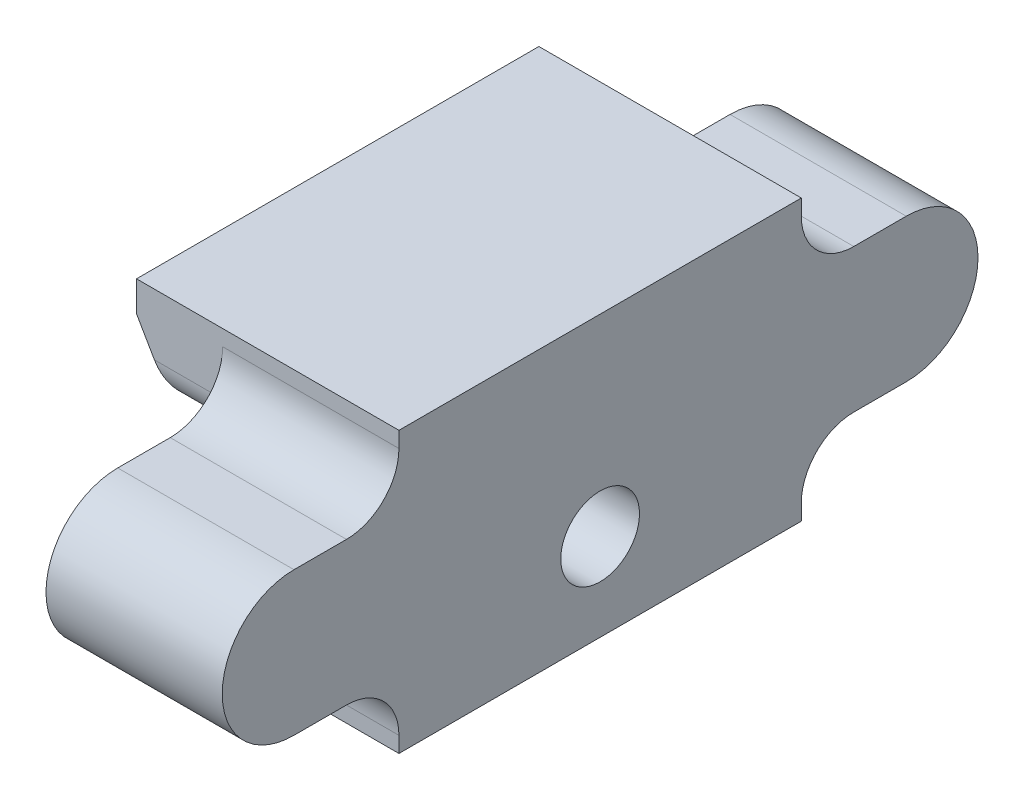
ISO-10303-21;
HEADER;
FILE_DESCRIPTION(('STEP AP214'),'2;1');
FILE_NAME('part.step','',(''),(''),'','','');
FILE_SCHEMA(('AUTOMOTIVE_DESIGN { 1 0 10303 214 1 1 1 1 }'));
ENDSEC;
DATA;
#1=APPLICATION_CONTEXT('core data for automotive mechanical design processes');
#2=APPLICATION_PROTOCOL_DEFINITION('international standard','automotive_design',2000,#1);
#3=PRODUCT_CONTEXT('',#1,'mechanical');
#4=PRODUCT('Part','Part','',(#3));
#5=PRODUCT_RELATED_PRODUCT_CATEGORY('part','',(#4));
#6=PRODUCT_DEFINITION_FORMATION('','',#4);
#7=PRODUCT_DEFINITION_CONTEXT('part definition',#1,'design');
#8=PRODUCT_DEFINITION('design','',#6,#7);
#9=PRODUCT_DEFINITION_SHAPE('','',#8);
#10=(LENGTH_UNIT() NAMED_UNIT(*) SI_UNIT(.MILLI.,.METRE.));
#11=(NAMED_UNIT(*) PLANE_ANGLE_UNIT() SI_UNIT($,.RADIAN.));
#12=(NAMED_UNIT(*) SI_UNIT($,.STERADIAN.) SOLID_ANGLE_UNIT());
#13=UNCERTAINTY_MEASURE_WITH_UNIT(LENGTH_MEASURE(1.E-05),#10,'distance_accuracy_value','');
#14=(GEOMETRIC_REPRESENTATION_CONTEXT(3) GLOBAL_UNCERTAINTY_ASSIGNED_CONTEXT((#13)) GLOBAL_UNIT_ASSIGNED_CONTEXT((#10,
#11,#12)) REPRESENTATION_CONTEXT('',''));
#15=CARTESIAN_POINT('',(0.,0.,0.));
#16=DIRECTION('',(0.,0.,1.));
#17=DIRECTION('',(1.,0.,0.));
#18=AXIS2_PLACEMENT_3D('',#15,#16,#17);
#19=CARTESIAN_POINT('',(0.,0.,23.));
#20=DIRECTION('',(0.,0.,-1.));
#21=DIRECTION('',(-1.,0.,0.));
#22=AXIS2_PLACEMENT_3D('',#19,#20,#21);
#23=PLANE('',#22);
#24=DIRECTION('',(0.,1.,0.));
#25=VECTOR('',#24,1.);
#26=CARTESIAN_POINT('',(0.,16.,23.));
#27=LINE('',#26,#25);
#28=CARTESIAN_POINT('',(0.,0.,23.));
#29=VERTEX_POINT('',#28);
#30=CARTESIAN_POINT('',(0.,0.900000000000001,23.));
#31=VERTEX_POINT('',#30);
#32=EDGE_CURVE('E281',#29,#31,#27,.T.);
#33=ORIENTED_EDGE('',*,*,#32,.T.);
#34=DIRECTION('',(1.,0.,0.));
#35=VECTOR('',#34,1.);
#36=CARTESIAN_POINT('',(-10.074573519457,0.900000000000001,23.));
#37=LINE('',#36,#35);
#38=CARTESIAN_POINT('',(-10.074573519457,0.900000000000001,23.));
#39=VERTEX_POINT('',#38);
#40=EDGE_CURVE('E292',#31,#39,#37,.F.);
#41=ORIENTED_EDGE('',*,*,#40,.T.);
#42=DIRECTION('',(0.,-1.,0.));
#43=VECTOR('',#42,1.);
#44=CARTESIAN_POINT('',(-10.074573519457,10.5,23.));
#45=LINE('',#44,#43);
#46=CARTESIAN_POINT('',(-10.074573519457,0.,23.));
#47=VERTEX_POINT('',#46);
#48=EDGE_CURVE('E293',#39,#47,#45,.T.);
#49=ORIENTED_EDGE('',*,*,#48,.T.);
#50=DIRECTION('',(1.,0.,0.));
#51=VECTOR('',#50,1.);
#52=CARTESIAN_POINT('',(0.,0.,23.));
#53=LINE('',#52,#51);
#54=EDGE_CURVE('E296',#47,#29,#53,.T.);
#55=ORIENTED_EDGE('',*,*,#54,.T.);
#56=EDGE_LOOP('',(#33,#41,#49,#55));
#57=FACE_BOUND('',#56,.T.);
#58=ADVANCED_FACE('F37',(#57),#23,.F.);
#59=CARTESIAN_POINT('',(0.,0.,0.));
#60=DIRECTION('',(0.,0.,-1.));
#61=DIRECTION('',(-1.,0.,0.));
#62=AXIS2_PLACEMENT_3D('',#59,#60,#61);
#63=PLANE('',#62);
#64=DIRECTION('',(0.,-1.,0.));
#65=VECTOR('',#64,1.);
#66=CARTESIAN_POINT('',(-10.074573519457,10.5,0.));
#67=LINE('',#66,#65);
#68=CARTESIAN_POINT('',(-10.074573519457,0.899999999999995,0.));
#69=VERTEX_POINT('',#68);
#70=CARTESIAN_POINT('',(-10.074573519457,0.,0.));
#71=VERTEX_POINT('',#70);
#72=EDGE_CURVE('E318',#69,#71,#67,.T.);
#73=ORIENTED_EDGE('',*,*,#72,.F.);
#74=DIRECTION('',(1.,0.,0.));
#75=VECTOR('',#74,1.);
#76=CARTESIAN_POINT('',(0.,0.899999999999996,0.));
#77=LINE('',#76,#75);
#78=CARTESIAN_POINT('',(0.,0.899999999999996,0.));
#79=VERTEX_POINT('',#78);
#80=EDGE_CURVE('E251',#69,#79,#77,.T.);
#81=ORIENTED_EDGE('',*,*,#80,.T.);
#82=DIRECTION('',(0.,1.,0.));
#83=VECTOR('',#82,1.);
#84=CARTESIAN_POINT('',(0.,16.,0.));
#85=LINE('',#84,#83);
#86=CARTESIAN_POINT('',(0.,0.,0.));
#87=VERTEX_POINT('',#86);
#88=EDGE_CURVE('E237',#87,#79,#85,.T.);
#89=ORIENTED_EDGE('',*,*,#88,.F.);
#90=DIRECTION('',(1.,0.,0.));
#91=VECTOR('',#90,1.);
#92=CARTESIAN_POINT('',(0.,0.,0.));
#93=LINE('',#92,#91);
#94=EDGE_CURVE('E320',#71,#87,#93,.T.);
#95=ORIENTED_EDGE('',*,*,#94,.F.);
#96=EDGE_LOOP('',(#73,#81,#89,#95));
#97=FACE_BOUND('',#96,.T.);
#98=ADVANCED_FACE('F388',(#97),#63,.T.);
#99=CARTESIAN_POINT('',(0.,16.,23.));
#100=DIRECTION('',(-1.,0.,0.));
#101=DIRECTION('',(0.,-1.,0.));
#102=AXIS2_PLACEMENT_3D('',#99,#100,#101);
#103=PLANE('',#102);
#104=CARTESIAN_POINT('',(0.,5.,11.5));
#105=DIRECTION('',(1.,0.,0.));
#106=DIRECTION('',(0.,0.,-1.));
#107=AXIS2_PLACEMENT_3D('',#104,#105,#106);
#108=CIRCLE('',#107,2.24999999999999);
#109=CARTESIAN_POINT('',(0.,5.,9.25000000000001));
#110=VERTEX_POINT('',#109);
#111=EDGE_CURVE('E215',#110,#110,#108,.T.);
#112=ORIENTED_EDGE('',*,*,#111,.F.);
#113=EDGE_LOOP('',(#112));
#114=FACE_BOUND('',#113,.T.);
#115=ORIENTED_EDGE('',*,*,#88,.T.);
#116=CARTESIAN_POINT('',(0.,0.899999999999996,-3.));
#117=DIRECTION('',(-1.,0.,0.));
#118=DIRECTION('',(0.,-1.,0.));
#119=AXIS2_PLACEMENT_3D('',#116,#117,#118);
#120=CIRCLE('',#119,3.);
#121=CARTESIAN_POINT('',(0.,3.9,-3.));
#122=VERTEX_POINT('',#121);
#123=EDGE_CURVE('E268',#79,#122,#120,.T.);
#124=ORIENTED_EDGE('',*,*,#123,.T.);
#125=DIRECTION('',(0.,0.,1.));
#126=VECTOR('',#125,1.);
#127=CARTESIAN_POINT('',(0.,3.9,0.));
#128=LINE('',#127,#126);
#129=CARTESIAN_POINT('',(0.,3.9,-6.));
#130=VERTEX_POINT('',#129);
#131=EDGE_CURVE('E220',#130,#122,#128,.T.);
#132=ORIENTED_EDGE('',*,*,#131,.F.);
#133=CARTESIAN_POINT('',(0.,8.,-6.));
#134=DIRECTION('',(-1.,0.,0.));
#135=DIRECTION('',(0.,-1.,0.));
#136=AXIS2_PLACEMENT_3D('',#133,#134,#135);
#137=CIRCLE('',#136,4.1);
#138=CARTESIAN_POINT('',(0.,12.1,-6.));
#139=VERTEX_POINT('',#138);
#140=EDGE_CURVE('E217',#139,#130,#137,.T.);
#141=ORIENTED_EDGE('',*,*,#140,.F.);
#142=DIRECTION('',(0.,0.,-1.));
#143=VECTOR('',#142,1.);
#144=CARTESIAN_POINT('',(0.,12.1,-6.));
#145=LINE('',#144,#143);
#146=CARTESIAN_POINT('',(0.,12.1,-3.));
#147=VERTEX_POINT('',#146);
#148=EDGE_CURVE('E225',#147,#139,#145,.T.);
#149=ORIENTED_EDGE('',*,*,#148,.F.);
#150=CARTESIAN_POINT('',(0.,15.1,-3.));
#151=DIRECTION('',(-1.,0.,0.));
#152=DIRECTION('',(0.,-1.,0.));
#153=AXIS2_PLACEMENT_3D('',#150,#151,#152);
#154=CIRCLE('',#153,3.);
#155=CARTESIAN_POINT('',(0.,15.1,0.));
#156=VERTEX_POINT('',#155);
#157=EDGE_CURVE('E264',#147,#156,#154,.T.);
#158=ORIENTED_EDGE('',*,*,#157,.T.);
#159=CARTESIAN_POINT('',(0.,16.,0.));
#160=VERTEX_POINT('',#159);
#161=EDGE_CURVE('E310',#156,#160,#85,.T.);
#162=ORIENTED_EDGE('',*,*,#161,.T.);
#163=DIRECTION('',(0.,0.,-1.));
#164=VECTOR('',#163,1.);
#165=CARTESIAN_POINT('',(0.,16.,23.));
#166=LINE('',#165,#164);
#167=CARTESIAN_POINT('',(0.,16.,23.));
#168=VERTEX_POINT('',#167);
#169=EDGE_CURVE('E335',#168,#160,#166,.T.);
#170=ORIENTED_EDGE('',*,*,#169,.F.);
#171=CARTESIAN_POINT('',(0.,15.1,23.));
#172=VERTEX_POINT('',#171);
#173=EDGE_CURVE('E325',#172,#168,#27,.T.);
#174=ORIENTED_EDGE('',*,*,#173,.F.);
#175=CARTESIAN_POINT('',(0.,15.1,26.));
#176=DIRECTION('',(-1.,0.,0.));
#177=DIRECTION('',(0.,-1.,0.));
#178=AXIS2_PLACEMENT_3D('',#175,#176,#177);
#179=CIRCLE('',#178,3.);
#180=CARTESIAN_POINT('',(0.,12.1,26.));
#181=VERTEX_POINT('',#180);
#182=EDGE_CURVE('E259',#172,#181,#179,.T.);
#183=ORIENTED_EDGE('',*,*,#182,.T.);
#184=DIRECTION('',(0.,0.,-1.));
#185=VECTOR('',#184,1.);
#186=CARTESIAN_POINT('',(0.,12.1,29.));
#187=LINE('',#186,#185);
#188=CARTESIAN_POINT('',(0.,12.1,29.));
#189=VERTEX_POINT('',#188);
#190=EDGE_CURVE('E191',#189,#181,#187,.T.);
#191=ORIENTED_EDGE('',*,*,#190,.F.);
#192=CARTESIAN_POINT('',(0.,8.,29.));
#193=DIRECTION('',(-1.,0.,0.));
#194=DIRECTION('',(0.,1.,0.));
#195=AXIS2_PLACEMENT_3D('',#192,#193,#194);
#196=CIRCLE('',#195,4.09999999999999);
#197=CARTESIAN_POINT('',(0.,3.90000000000001,29.));
#198=VERTEX_POINT('',#197);
#199=EDGE_CURVE('E190',#198,#189,#196,.T.);
#200=ORIENTED_EDGE('',*,*,#199,.F.);
#201=DIRECTION('',(0.,0.,1.));
#202=VECTOR('',#201,1.);
#203=CARTESIAN_POINT('',(0.,3.9,23.));
#204=LINE('',#203,#202);
#205=CARTESIAN_POINT('',(0.,3.9,26.));
#206=VERTEX_POINT('',#205);
#207=EDGE_CURVE('E180',#206,#198,#204,.T.);
#208=ORIENTED_EDGE('',*,*,#207,.F.);
#209=CARTESIAN_POINT('',(0.,0.900000000000002,26.));
#210=DIRECTION('',(-1.,0.,0.));
#211=DIRECTION('',(0.,-1.,0.));
#212=AXIS2_PLACEMENT_3D('',#209,#210,#211);
#213=CIRCLE('',#212,3.);
#214=EDGE_CURVE('E255',#206,#31,#213,.T.);
#215=ORIENTED_EDGE('',*,*,#214,.T.);
#216=ORIENTED_EDGE('',*,*,#32,.F.);
#217=DIRECTION('',(0.,0.,-1.));
#218=VECTOR('',#217,1.);
#219=CARTESIAN_POINT('',(0.,0.,23.));
#220=LINE('',#219,#218);
#221=EDGE_CURVE('E303',#29,#87,#220,.T.);
#222=ORIENTED_EDGE('',*,*,#221,.T.);
#223=EDGE_LOOP('',(#115,#124,#132,#141,#149,#158,#162,#170,#174,#183,#191,#200,#208,#215,#216,#222));
#224=FACE_BOUND('',#223,.T.);
#225=ADVANCED_FACE('F203',(#114,#224),#103,.F.);
#226=CARTESIAN_POINT('',(-16.,16.,23.));
#227=DIRECTION('',(0.,-1.,0.));
#228=DIRECTION('',(1.,0.,0.));
#229=AXIS2_PLACEMENT_3D('',#226,#227,#228);
#230=PLANE('',#229);
#231=DIRECTION('',(-1.,0.,0.));
#232=VECTOR('',#231,1.);
#233=CARTESIAN_POINT('',(-16.,16.,0.));
#234=LINE('',#233,#232);
#235=CARTESIAN_POINT('',(-15.,16.,0.));
#236=VERTEX_POINT('',#235);
#237=EDGE_CURVE('E306',#160,#236,#234,.T.);
#238=ORIENTED_EDGE('',*,*,#237,.T.);
#239=DIRECTION('',(0.,0.,1.));
#240=VECTOR('',#239,1.);
#241=CARTESIAN_POINT('',(-15.,16.,23.));
#242=LINE('',#241,#240);
#243=CARTESIAN_POINT('',(-15.,16.,23.));
#244=VERTEX_POINT('',#243);
#245=EDGE_CURVE('E353',#236,#244,#242,.T.);
#246=ORIENTED_EDGE('',*,*,#245,.T.);
#247=DIRECTION('',(-1.,0.,0.));
#248=VECTOR('',#247,1.);
#249=CARTESIAN_POINT('',(-16.,16.,23.));
#250=LINE('',#249,#248);
#251=EDGE_CURVE('E363',#168,#244,#250,.T.);
#252=ORIENTED_EDGE('',*,*,#251,.F.);
#253=ORIENTED_EDGE('',*,*,#169,.T.);
#254=EDGE_LOOP('',(#238,#246,#252,#253));
#255=FACE_BOUND('',#254,.T.);
#256=ADVANCED_FACE('F378',(#255),#230,.F.);
#257=CARTESIAN_POINT('',(-12.824573519457,10.5,23.));
#258=DIRECTION('',(0.866025403784435,0.500000000000006,0.));
#259=DIRECTION('',(-0.500000000000006,0.866025403784435,0.));
#260=AXIS2_PLACEMENT_3D('',#257,#258,#259);
#261=PLANE('',#260);
#262=DIRECTION('',(0.,0.,-1.));
#263=VECTOR('',#262,1.);
#264=CARTESIAN_POINT('',(-12.824573519457,10.5,23.));
#265=LINE('',#264,#263);
#266=CARTESIAN_POINT('',(-12.824573519457,10.5,21.));
#267=VERTEX_POINT('',#266);
#268=CARTESIAN_POINT('',(-12.824573519457,10.5,2.));
#269=VERTEX_POINT('',#268);
#270=EDGE_CURVE('E332',#267,#269,#265,.T.);
#271=ORIENTED_EDGE('',*,*,#270,.F.);
#272=CARTESIAN_POINT('',(-13.9792740578363,12.5,21.));
#273=DIRECTION('',(0.866025403784435,0.500000000000006,0.));
#274=DIRECTION('',(0.500000000000006,-0.866025403784435,0.));
#275=AXIS2_PLACEMENT_3D('',#272,#273,#274);
#276=ELLIPSE('',#275,2.30940107675851,2.);
#277=CARTESIAN_POINT('',(-13.9792740578363,12.5,23.));
#278=VERTEX_POINT('',#277);
#279=EDGE_CURVE('E371',#267,#278,#276,.F.);
#280=ORIENTED_EDGE('',*,*,#279,.T.);
#281=DIRECTION('',(0.500000000000006,-0.866025403784435,0.));
#282=VECTOR('',#281,1.);
#283=CARTESIAN_POINT('',(-12.824573519457,10.5,23.));
#284=LINE('',#283,#282);
#285=CARTESIAN_POINT('',(-15.,14.2679491924311,23.));
#286=VERTEX_POINT('',#285);
#287=EDGE_CURVE('E297',#286,#278,#284,.T.);
#288=ORIENTED_EDGE('',*,*,#287,.F.);
#289=DIRECTION('',(0.,0.,-1.));
#290=VECTOR('',#289,1.);
#291=CARTESIAN_POINT('',(-15.,14.2679491924311,23.));
#292=LINE('',#291,#290);
#293=CARTESIAN_POINT('',(-15.,14.2679491924312,0.));
#294=VERTEX_POINT('',#293);
#295=EDGE_CURVE('E338',#286,#294,#292,.T.);
#296=ORIENTED_EDGE('',*,*,#295,.T.);
#297=DIRECTION('',(0.500000000000006,-0.866025403784435,0.));
#298=VECTOR('',#297,1.);
#299=CARTESIAN_POINT('',(-12.824573519457,10.5,0.));
#300=LINE('',#299,#298);
#301=CARTESIAN_POINT('',(-13.9792740578363,12.5,0.));
#302=VERTEX_POINT('',#301);
#303=EDGE_CURVE('E321',#294,#302,#300,.T.);
#304=ORIENTED_EDGE('',*,*,#303,.T.);
#305=CARTESIAN_POINT('',(-13.9792740578363,12.5,2.));
#306=DIRECTION('',(0.866025403784435,0.500000000000006,0.));
#307=DIRECTION('',(-0.500000000000006,0.866025403784435,0.));
#308=AXIS2_PLACEMENT_3D('',#305,#306,#307);
#309=ELLIPSE('',#308,2.30940107675851,2.);
#310=EDGE_CURVE('E678',#302,#269,#309,.F.);
#311=ORIENTED_EDGE('',*,*,#310,.T.);
#312=EDGE_LOOP('',(#271,#280,#288,#296,#304,#311));
#313=FACE_BOUND('',#312,.T.);
#314=ADVANCED_FACE('F369',(#313),#261,.F.);
#315=CARTESIAN_POINT('',(-12.824573519457,10.5,23.));
#316=DIRECTION('',(0.,1.,0.));
#317=DIRECTION('',(0.,0.,1.));
#318=AXIS2_PLACEMENT_3D('',#315,#316,#317);
#319=PLANE('',#318);
#320=DIRECTION('',(0.,0.,-1.));
#321=VECTOR('',#320,1.);
#322=CARTESIAN_POINT('',(-10.074573519457,10.5,23.));
#323=LINE('',#322,#321);
#324=CARTESIAN_POINT('',(-10.074573519457,10.5,21.));
#325=VERTEX_POINT('',#324);
#326=CARTESIAN_POINT('',(-10.074573519457,10.5,2.));
#327=VERTEX_POINT('',#326);
#328=EDGE_CURVE('E331',#325,#327,#323,.T.);
#329=ORIENTED_EDGE('',*,*,#328,.F.);
#330=DIRECTION('',(1.,0.,0.));
#331=VECTOR('',#330,1.);
#332=CARTESIAN_POINT('',(-12.824573519457,10.5,21.));
#333=LINE('',#332,#331);
#334=EDGE_CURVE('E675',#325,#267,#333,.F.);
#335=ORIENTED_EDGE('',*,*,#334,.T.);
#336=ORIENTED_EDGE('',*,*,#270,.T.);
#337=DIRECTION('',(1.,0.,0.));
#338=VECTOR('',#337,1.);
#339=CARTESIAN_POINT('',(-10.074573519457,10.5,2.));
#340=LINE('',#339,#338);
#341=EDGE_CURVE('E677',#269,#327,#340,.T.);
#342=ORIENTED_EDGE('',*,*,#341,.T.);
#343=EDGE_LOOP('',(#329,#335,#336,#342));
#344=FACE_BOUND('',#343,.T.);
#345=ADVANCED_FACE('F435',(#344),#319,.F.);
#346=CARTESIAN_POINT('',(-10.074573519457,10.5,23.));
#347=DIRECTION('',(1.,0.,0.));
#348=DIRECTION('',(0.,1.,0.));
#349=AXIS2_PLACEMENT_3D('',#346,#347,#348);
#350=PLANE('',#349);
#351=CARTESIAN_POINT('',(-10.074573519457,5.,11.5));
#352=DIRECTION('',(1.,0.,0.));
#353=DIRECTION('',(0.,1.,0.));
#354=AXIS2_PLACEMENT_3D('',#351,#352,#353);
#355=CIRCLE('',#354,2.24999999999999);
#356=CARTESIAN_POINT('',(-10.074573519457,7.24999999999999,11.5));
#357=VERTEX_POINT('',#356);
#358=EDGE_CURVE('E346',#357,#357,#355,.T.);
#359=ORIENTED_EDGE('',*,*,#358,.T.);
#360=EDGE_LOOP('',(#359));
#361=FACE_BOUND('',#360,.T.);
#362=CARTESIAN_POINT('',(-10.074573519457,5.,4.));
#363=DIRECTION('',(1.,0.,0.));
#364=DIRECTION('',(0.,1.,0.));
#365=AXIS2_PLACEMENT_3D('',#362,#363,#364);
#366=CIRCLE('',#365,2.5);
#367=CARTESIAN_POINT('',(-10.074573519457,7.5,4.));
#368=VERTEX_POINT('',#367);
#369=EDGE_CURVE('E342',#368,#368,#366,.T.);
#370=ORIENTED_EDGE('',*,*,#369,.T.);
#371=EDGE_LOOP('',(#370));
#372=FACE_BOUND('',#371,.T.);
#373=CARTESIAN_POINT('',(-10.074573519457,5.,19.));
#374=DIRECTION('',(1.,0.,0.));
#375=DIRECTION('',(0.,1.,0.));
#376=AXIS2_PLACEMENT_3D('',#373,#374,#375);
#377=CIRCLE('',#376,2.5);
#378=CARTESIAN_POINT('',(-10.074573519457,7.5,19.));
#379=VERTEX_POINT('',#378);
#380=EDGE_CURVE('E313',#379,#379,#377,.T.);
#381=ORIENTED_EDGE('',*,*,#380,.T.);
#382=EDGE_LOOP('',(#381));
#383=FACE_BOUND('',#382,.T.);
#384=DIRECTION('',(0.,1.,0.));
#385=VECTOR('',#384,1.);
#386=CARTESIAN_POINT('',(-10.074573519457,12.1,23.));
#387=LINE('',#386,#385);
#388=CARTESIAN_POINT('',(-10.074573519457,12.5,23.));
#389=VERTEX_POINT('',#388);
#390=CARTESIAN_POINT('',(-10.074573519457,15.1,23.));
#391=VERTEX_POINT('',#390);
#392=EDGE_CURVE('E273',#389,#391,#387,.T.);
#393=ORIENTED_EDGE('',*,*,#392,.F.);
#394=CARTESIAN_POINT('',(-10.074573519457,12.5,21.));
#395=DIRECTION('',(1.,0.,0.));
#396=DIRECTION('',(0.,1.,0.));
#397=AXIS2_PLACEMENT_3D('',#394,#395,#396);
#398=CIRCLE('',#397,2.);
#399=EDGE_CURVE('E45',#389,#325,#398,.T.);
#400=ORIENTED_EDGE('',*,*,#399,.T.);
#401=ORIENTED_EDGE('',*,*,#328,.T.);
#402=CARTESIAN_POINT('',(-10.074573519457,12.5,2.));
#403=DIRECTION('',(1.,0.,0.));
#404=DIRECTION('',(0.,1.,0.));
#405=AXIS2_PLACEMENT_3D('',#402,#403,#404);
#406=CIRCLE('',#405,2.);
#407=CARTESIAN_POINT('',(-10.074573519457,12.5,0.));
#408=VERTEX_POINT('',#407);
#409=EDGE_CURVE('E11',#327,#408,#406,.T.);
#410=ORIENTED_EDGE('',*,*,#409,.T.);
#411=DIRECTION('',(0.,-1.,0.));
#412=VECTOR('',#411,1.);
#413=CARTESIAN_POINT('',(-10.074573519457,12.1,0.));
#414=LINE('',#413,#412);
#415=CARTESIAN_POINT('',(-10.074573519457,15.1,0.));
#416=VERTEX_POINT('',#415);
#417=EDGE_CURVE('E230',#416,#408,#414,.T.);
#418=ORIENTED_EDGE('',*,*,#417,.F.);
#419=CARTESIAN_POINT('',(-10.074573519457,15.1,-3.));
#420=DIRECTION('',(1.,0.,0.));
#421=DIRECTION('',(0.,1.,0.));
#422=AXIS2_PLACEMENT_3D('',#419,#420,#421);
#423=CIRCLE('',#422,3.);
#424=CARTESIAN_POINT('',(-10.074573519457,12.1,-3.));
#425=VERTEX_POINT('',#424);
#426=EDGE_CURVE('E266',#416,#425,#423,.T.);
#427=ORIENTED_EDGE('',*,*,#426,.T.);
#428=DIRECTION('',(0.,0.,1.));
#429=VECTOR('',#428,1.);
#430=CARTESIAN_POINT('',(-10.074573519457,12.1,-6.));
#431=LINE('',#430,#429);
#432=CARTESIAN_POINT('',(-10.074573519457,12.1,-6.));
#433=VERTEX_POINT('',#432);
#434=EDGE_CURVE('E227',#433,#425,#431,.T.);
#435=ORIENTED_EDGE('',*,*,#434,.F.);
#436=CARTESIAN_POINT('',(-10.074573519457,8.,-6.));
#437=DIRECTION('',(1.,0.,0.));
#438=DIRECTION('',(0.,1.,0.));
#439=AXIS2_PLACEMENT_3D('',#436,#437,#438);
#440=CIRCLE('',#439,4.1);
#441=CARTESIAN_POINT('',(-10.074573519457,3.89999999999999,-6.));
#442=VERTEX_POINT('',#441);
#443=EDGE_CURVE('E212',#442,#433,#440,.T.);
#444=ORIENTED_EDGE('',*,*,#443,.F.);
#445=DIRECTION('',(0.,0.,-1.));
#446=VECTOR('',#445,1.);
#447=CARTESIAN_POINT('',(-10.074573519457,3.9,0.));
#448=LINE('',#447,#446);
#449=CARTESIAN_POINT('',(-10.074573519457,3.89999999999999,-3.));
#450=VERTEX_POINT('',#449);
#451=EDGE_CURVE('E216',#450,#442,#448,.T.);
#452=ORIENTED_EDGE('',*,*,#451,.F.);
#453=CARTESIAN_POINT('',(-10.074573519457,0.899999999999995,-3.));
#454=DIRECTION('',(1.,0.,0.));
#455=DIRECTION('',(0.,1.,0.));
#456=AXIS2_PLACEMENT_3D('',#453,#454,#455);
#457=CIRCLE('',#456,3.);
#458=EDGE_CURVE('E270',#450,#69,#457,.T.);
#459=ORIENTED_EDGE('',*,*,#458,.T.);
#460=ORIENTED_EDGE('',*,*,#72,.T.);
#461=DIRECTION('',(0.,0.,-1.));
#462=VECTOR('',#461,1.);
#463=CARTESIAN_POINT('',(-10.074573519457,0.,23.));
#464=LINE('',#463,#462);
#465=EDGE_CURVE('E328',#47,#71,#464,.T.);
#466=ORIENTED_EDGE('',*,*,#465,.F.);
#467=ORIENTED_EDGE('',*,*,#48,.F.);
#468=CARTESIAN_POINT('',(-10.074573519457,0.900000000000001,26.));
#469=DIRECTION('',(1.,0.,0.));
#470=DIRECTION('',(0.,1.,0.));
#471=AXIS2_PLACEMENT_3D('',#468,#469,#470);
#472=CIRCLE('',#471,3.);
#473=CARTESIAN_POINT('',(-10.074573519457,3.9,26.));
#474=VERTEX_POINT('',#473);
#475=EDGE_CURVE('E257',#39,#474,#472,.T.);
#476=ORIENTED_EDGE('',*,*,#475,.T.);
#477=DIRECTION('',(0.,0.,-1.));
#478=VECTOR('',#477,1.);
#479=CARTESIAN_POINT('',(-10.074573519457,3.9,23.));
#480=LINE('',#479,#478);
#481=CARTESIAN_POINT('',(-10.074573519457,3.90000000000001,29.));
#482=VERTEX_POINT('',#481);
#483=EDGE_CURVE('E211',#482,#474,#480,.T.);
#484=ORIENTED_EDGE('',*,*,#483,.F.);
#485=CARTESIAN_POINT('',(-10.074573519457,8.,29.));
#486=DIRECTION('',(1.,0.,0.));
#487=DIRECTION('',(0.,1.,0.));
#488=AXIS2_PLACEMENT_3D('',#485,#486,#487);
#489=CIRCLE('',#488,4.09999999999999);
#490=CARTESIAN_POINT('',(-10.074573519457,12.1,29.));
#491=VERTEX_POINT('',#490);
#492=EDGE_CURVE('E199',#491,#482,#489,.T.);
#493=ORIENTED_EDGE('',*,*,#492,.F.);
#494=DIRECTION('',(0.,0.,1.));
#495=VECTOR('',#494,1.);
#496=CARTESIAN_POINT('',(-10.074573519457,12.1,29.));
#497=LINE('',#496,#495);
#498=CARTESIAN_POINT('',(-10.074573519457,12.1,26.));
#499=VERTEX_POINT('',#498);
#500=EDGE_CURVE('E208',#499,#491,#497,.T.);
#501=ORIENTED_EDGE('',*,*,#500,.F.);
#502=CARTESIAN_POINT('',(-10.074573519457,15.1,26.));
#503=DIRECTION('',(1.,0.,0.));
#504=DIRECTION('',(0.,1.,0.));
#505=AXIS2_PLACEMENT_3D('',#502,#503,#504);
#506=CIRCLE('',#505,3.);
#507=EDGE_CURVE('E261',#499,#391,#506,.T.);
#508=ORIENTED_EDGE('',*,*,#507,.T.);
#509=EDGE_LOOP('',(#393,#400,#401,#410,#418,#427,#435,#444,#452,#459,#460,#466,#467,#476,#484,
#493,#501,#508));
#510=FACE_BOUND('',#509,.T.);
#511=ADVANCED_FACE('F399',(#361,#372,#383,#510),#350,.F.);
#512=CARTESIAN_POINT('',(0.,0.,23.));
#513=DIRECTION('',(0.,1.,0.));
#514=DIRECTION('',(-1.,0.,0.));
#515=AXIS2_PLACEMENT_3D('',#512,#513,#514);
#516=PLANE('',#515);
#517=ORIENTED_EDGE('',*,*,#94,.T.);
#518=ORIENTED_EDGE('',*,*,#221,.F.);
#519=ORIENTED_EDGE('',*,*,#54,.F.);
#520=ORIENTED_EDGE('',*,*,#465,.T.);
#521=EDGE_LOOP('',(#517,#518,#519,#520));
#522=FACE_BOUND('',#521,.T.);
#523=ADVANCED_FACE('F427',(#522),#516,.F.);
#524=ORIENTED_EDGE('',*,*,#287,.T.);
#525=DIRECTION('',(1.,0.,0.));
#526=VECTOR('',#525,1.);
#527=CARTESIAN_POINT('',(0.,12.5,23.));
#528=LINE('',#527,#526);
#529=EDGE_CURVE('E272',#278,#389,#528,.T.);
#530=ORIENTED_EDGE('',*,*,#529,.T.);
#531=ORIENTED_EDGE('',*,*,#392,.T.);
#532=DIRECTION('',(1.,0.,0.));
#533=VECTOR('',#532,1.);
#534=CARTESIAN_POINT('',(0.,15.1,23.));
#535=LINE('',#534,#533);
#536=EDGE_CURVE('E412',#391,#172,#535,.T.);
#537=ORIENTED_EDGE('',*,*,#536,.T.);
#538=ORIENTED_EDGE('',*,*,#173,.T.);
#539=ORIENTED_EDGE('',*,*,#251,.T.);
#540=DIRECTION('',(0.,1.,0.));
#541=VECTOR('',#540,1.);
#542=CARTESIAN_POINT('',(-15.,14.2679491924311,23.));
#543=LINE('',#542,#541);
#544=EDGE_CURVE('E276',#244,#286,#543,.F.);
#545=ORIENTED_EDGE('',*,*,#544,.T.);
#546=EDGE_LOOP('',(#524,#530,#531,#537,#538,#539,#545));
#547=FACE_BOUND('',#546,.T.);
#548=ADVANCED_FACE('F359',(#547),#23,.F.);
#549=ORIENTED_EDGE('',*,*,#417,.T.);
#550=DIRECTION('',(1.,0.,0.));
#551=VECTOR('',#550,1.);
#552=CARTESIAN_POINT('',(-12.824573519457,12.5,0.));
#553=LINE('',#552,#551);
#554=EDGE_CURVE('E57',#408,#302,#553,.F.);
#555=ORIENTED_EDGE('',*,*,#554,.T.);
#556=ORIENTED_EDGE('',*,*,#303,.F.);
#557=DIRECTION('',(0.,-1.,0.));
#558=VECTOR('',#557,1.);
#559=CARTESIAN_POINT('',(-15.,0.,0.));
#560=LINE('',#559,#558);
#561=EDGE_CURVE('E351',#294,#236,#560,.F.);
#562=ORIENTED_EDGE('',*,*,#561,.T.);
#563=ORIENTED_EDGE('',*,*,#237,.F.);
#564=ORIENTED_EDGE('',*,*,#161,.F.);
#565=DIRECTION('',(1.,0.,0.));
#566=VECTOR('',#565,1.);
#567=CARTESIAN_POINT('',(0.,15.1,0.));
#568=LINE('',#567,#566);
#569=EDGE_CURVE('E316',#156,#416,#568,.F.);
#570=ORIENTED_EDGE('',*,*,#569,.T.);
#571=EDGE_LOOP('',(#549,#555,#556,#562,#563,#564,#570));
#572=FACE_BOUND('',#571,.T.);
#573=ADVANCED_FACE('F375',(#572),#63,.T.);
#574=CARTESIAN_POINT('',(-16.,5.,19.));
#575=DIRECTION('',(1.,0.,0.));
#576=DIRECTION('',(0.,0.,-1.));
#577=AXIS2_PLACEMENT_3D('',#574,#575,#576);
#578=CYLINDRICAL_SURFACE('',#577,2.5);
#579=CARTESIAN_POINT('',(-6.07457351945701,5.,19.));
#580=DIRECTION('',(1.,0.,0.));
#581=DIRECTION('',(0.,0.,-1.));
#582=AXIS2_PLACEMENT_3D('',#579,#580,#581);
#583=CIRCLE('',#582,2.5);
#584=CARTESIAN_POINT('',(-6.07457351945701,5.,16.5));
#585=VERTEX_POINT('',#584);
#586=EDGE_CURVE('E341',#585,#585,#583,.T.);
#587=ORIENTED_EDGE('',*,*,#586,.T.);
#588=EDGE_LOOP('',(#587));
#589=FACE_BOUND('',#588,.T.);
#590=ORIENTED_EDGE('',*,*,#380,.F.);
#591=EDGE_LOOP('',(#590));
#592=FACE_BOUND('',#591,.T.);
#593=ADVANCED_FACE('F444',(#589,#592),#578,.F.);
#594=CARTESIAN_POINT('',(-6.07457351945701,5.,19.));
#595=DIRECTION('',(1.,0.,0.));
#596=DIRECTION('',(0.,0.,-1.));
#597=AXIS2_PLACEMENT_3D('',#594,#595,#596);
#598=PLANE('',#597);
#599=ORIENTED_EDGE('',*,*,#586,.F.);
#600=EDGE_LOOP('',(#599));
#601=FACE_BOUND('',#600,.T.);
#602=ADVANCED_FACE('F450',(#601),#598,.F.);
#603=CARTESIAN_POINT('',(-16.,5.,4.));
#604=DIRECTION('',(1.,0.,0.));
#605=DIRECTION('',(0.,0.,-1.));
#606=AXIS2_PLACEMENT_3D('',#603,#604,#605);
#607=CYLINDRICAL_SURFACE('',#606,2.5);
#608=CARTESIAN_POINT('',(-6.07457351945701,5.,4.));
#609=DIRECTION('',(1.,0.,0.));
#610=DIRECTION('',(0.,0.,1.));
#611=AXIS2_PLACEMENT_3D('',#608,#609,#610);
#612=CIRCLE('',#611,2.5);
#613=CARTESIAN_POINT('',(-6.07457351945701,5.,6.5));
#614=VERTEX_POINT('',#613);
#615=EDGE_CURVE('E345',#614,#614,#612,.T.);
#616=ORIENTED_EDGE('',*,*,#615,.T.);
#617=EDGE_LOOP('',(#616));
#618=FACE_BOUND('',#617,.T.);
#619=ORIENTED_EDGE('',*,*,#369,.F.);
#620=EDGE_LOOP('',(#619));
#621=FACE_BOUND('',#620,.T.);
#622=ADVANCED_FACE('F455',(#618,#621),#607,.F.);
#623=CARTESIAN_POINT('',(-6.07457351945701,5.,4.));
#624=DIRECTION('',(-1.,0.,0.));
#625=DIRECTION('',(0.,0.,1.));
#626=AXIS2_PLACEMENT_3D('',#623,#624,#625);
#627=PLANE('',#626);
#628=ORIENTED_EDGE('',*,*,#615,.F.);
#629=EDGE_LOOP('',(#628));
#630=FACE_BOUND('',#629,.T.);
#631=ADVANCED_FACE('F465',(#630),#627,.T.);
#632=CARTESIAN_POINT('',(0.,5.,11.5));
#633=DIRECTION('',(1.,0.,0.));
#634=DIRECTION('',(0.,0.,-1.));
#635=AXIS2_PLACEMENT_3D('',#632,#633,#634);
#636=CYLINDRICAL_SURFACE('',#635,2.24999999999999);
#637=ORIENTED_EDGE('',*,*,#111,.T.);
#638=EDGE_LOOP('',(#637));
#639=FACE_BOUND('',#638,.T.);
#640=ORIENTED_EDGE('',*,*,#358,.F.);
#641=EDGE_LOOP('',(#640));
#642=FACE_BOUND('',#641,.T.);
#643=ADVANCED_FACE('F471',(#639,#642),#636,.F.);
#644=CARTESIAN_POINT('',(-15.,14.2679491924311,23.));
#645=DIRECTION('',(1.,0.,0.));
#646=DIRECTION('',(0.,0.,-1.));
#647=AXIS2_PLACEMENT_3D('',#644,#645,#646);
#648=PLANE('',#647);
#649=ORIENTED_EDGE('',*,*,#544,.F.);
#650=ORIENTED_EDGE('',*,*,#245,.F.);
#651=ORIENTED_EDGE('',*,*,#561,.F.);
#652=ORIENTED_EDGE('',*,*,#295,.F.);
#653=EDGE_LOOP('',(#649,#650,#651,#652));
#654=FACE_BOUND('',#653,.T.);
#655=ADVANCED_FACE('F372',(#654),#648,.F.);
#656=CARTESIAN_POINT('',(-23.0841853507147,12.1,-6.));
#657=DIRECTION('',(0.,-1.,0.));
#658=DIRECTION('',(1.,0.,0.));
#659=AXIS2_PLACEMENT_3D('',#656,#657,#658);
#660=PLANE('',#659);
#661=ORIENTED_EDGE('',*,*,#434,.T.);
#662=DIRECTION('',(1.,0.,0.));
#663=VECTOR('',#662,1.);
#664=CARTESIAN_POINT('',(-23.0841853507147,12.1,-3.));
#665=LINE('',#664,#663);
#666=EDGE_CURVE('E314',#425,#147,#665,.T.);
#667=ORIENTED_EDGE('',*,*,#666,.T.);
#668=ORIENTED_EDGE('',*,*,#148,.T.);
#669=DIRECTION('',(1.,0.,0.));
#670=VECTOR('',#669,1.);
#671=CARTESIAN_POINT('',(-23.0841853507147,12.1,-6.));
#672=LINE('',#671,#670);
#673=EDGE_CURVE('E221',#433,#139,#672,.T.);
#674=ORIENTED_EDGE('',*,*,#673,.F.);
#675=EDGE_LOOP('',(#661,#667,#668,#674));
#676=FACE_BOUND('',#675,.T.);
#677=ADVANCED_FACE('F480',(#676),#660,.F.);
#678=CARTESIAN_POINT('',(-23.0841853507147,3.89999999999999,0.));
#679=DIRECTION('',(0.,1.,0.));
#680=DIRECTION('',(0.,0.,1.));
#681=AXIS2_PLACEMENT_3D('',#678,#679,#680);
#682=PLANE('',#681);
#683=ORIENTED_EDGE('',*,*,#131,.T.);
#684=DIRECTION('',(1.,0.,0.));
#685=VECTOR('',#684,1.);
#686=CARTESIAN_POINT('',(-23.0841853507147,3.89999999999999,-3.));
#687=LINE('',#686,#685);
#688=EDGE_CURVE('E253',#122,#450,#687,.F.);
#689=ORIENTED_EDGE('',*,*,#688,.T.);
#690=ORIENTED_EDGE('',*,*,#451,.T.);
#691=DIRECTION('',(1.,0.,0.));
#692=VECTOR('',#691,1.);
#693=CARTESIAN_POINT('',(-23.0841853507147,3.89999999999999,-6.));
#694=LINE('',#693,#692);
#695=EDGE_CURVE('E224',#442,#130,#694,.T.);
#696=ORIENTED_EDGE('',*,*,#695,.T.);
#697=EDGE_LOOP('',(#683,#689,#690,#696));
#698=FACE_BOUND('',#697,.T.);
#699=ADVANCED_FACE('F396',(#698),#682,.F.);
#700=CARTESIAN_POINT('',(-23.0841853507147,8.,-6.));
#701=DIRECTION('',(1.,0.,0.));
#702=DIRECTION('',(0.,1.,0.));
#703=AXIS2_PLACEMENT_3D('',#700,#701,#702);
#704=CYLINDRICAL_SURFACE('',#703,4.1);
#705=ORIENTED_EDGE('',*,*,#695,.F.);
#706=ORIENTED_EDGE('',*,*,#443,.T.);
#707=ORIENTED_EDGE('',*,*,#673,.T.);
#708=ORIENTED_EDGE('',*,*,#140,.T.);
#709=EDGE_LOOP('',(#705,#706,#707,#708));
#710=FACE_BOUND('',#709,.T.);
#711=ADVANCED_FACE('F403',(#710),#704,.T.);
#712=CARTESIAN_POINT('',(-23.0841853507147,8.,29.));
#713=DIRECTION('',(1.,0.,0.));
#714=DIRECTION('',(0.,1.,0.));
#715=AXIS2_PLACEMENT_3D('',#712,#713,#714);
#716=CYLINDRICAL_SURFACE('',#715,4.09999999999999);
#717=DIRECTION('',(1.,0.,0.));
#718=VECTOR('',#717,1.);
#719=CARTESIAN_POINT('',(-23.0841853507147,12.1,29.));
#720=LINE('',#719,#718);
#721=EDGE_CURVE('E200',#491,#189,#720,.T.);
#722=ORIENTED_EDGE('',*,*,#721,.F.);
#723=ORIENTED_EDGE('',*,*,#492,.T.);
#724=DIRECTION('',(1.,0.,0.));
#725=VECTOR('',#724,1.);
#726=CARTESIAN_POINT('',(-23.0841853507147,3.90000000000001,29.));
#727=LINE('',#726,#725);
#728=EDGE_CURVE('E184',#482,#198,#727,.T.);
#729=ORIENTED_EDGE('',*,*,#728,.T.);
#730=ORIENTED_EDGE('',*,*,#199,.T.);
#731=EDGE_LOOP('',(#722,#723,#729,#730));
#732=FACE_BOUND('',#731,.T.);
#733=ADVANCED_FACE('F196',(#732),#716,.T.);
#734=CARTESIAN_POINT('',(-23.0841853507147,3.89999999999999,23.));
#735=DIRECTION('',(0.,1.,0.));
#736=DIRECTION('',(0.,0.,1.));
#737=AXIS2_PLACEMENT_3D('',#734,#735,#736);
#738=PLANE('',#737);
#739=ORIENTED_EDGE('',*,*,#483,.T.);
#740=DIRECTION('',(1.,0.,0.));
#741=VECTOR('',#740,1.);
#742=CARTESIAN_POINT('',(0.,3.9,26.));
#743=LINE('',#742,#741);
#744=EDGE_CURVE('E187',#474,#206,#743,.T.);
#745=ORIENTED_EDGE('',*,*,#744,.T.);
#746=ORIENTED_EDGE('',*,*,#207,.T.);
#747=ORIENTED_EDGE('',*,*,#728,.F.);
#748=EDGE_LOOP('',(#739,#745,#746,#747));
#749=FACE_BOUND('',#748,.T.);
#750=ADVANCED_FACE('F183',(#749),#738,.F.);
#751=CARTESIAN_POINT('',(-23.0841853507147,12.1,29.));
#752=DIRECTION('',(0.,-1.,0.));
#753=DIRECTION('',(1.,0.,0.));
#754=AXIS2_PLACEMENT_3D('',#751,#752,#753);
#755=PLANE('',#754);
#756=ORIENTED_EDGE('',*,*,#190,.T.);
#757=DIRECTION('',(1.,0.,0.));
#758=VECTOR('',#757,1.);
#759=CARTESIAN_POINT('',(-10.074573519457,12.1,26.));
#760=LINE('',#759,#758);
#761=EDGE_CURVE('E409',#181,#499,#760,.F.);
#762=ORIENTED_EDGE('',*,*,#761,.T.);
#763=ORIENTED_EDGE('',*,*,#500,.T.);
#764=ORIENTED_EDGE('',*,*,#721,.T.);
#765=EDGE_LOOP('',(#756,#762,#763,#764));
#766=FACE_BOUND('',#765,.T.);
#767=ADVANCED_FACE('F483',(#766),#755,.F.);
#768=CARTESIAN_POINT('',(-23.0841853507147,0.9,26.));
#769=DIRECTION('',(-1.,0.,0.));
#770=DIRECTION('',(0.,-1.,0.));
#771=AXIS2_PLACEMENT_3D('',#768,#769,#770);
#772=CYLINDRICAL_SURFACE('',#771,3.);
#773=ORIENTED_EDGE('',*,*,#475,.F.);
#774=ORIENTED_EDGE('',*,*,#40,.F.);
#775=ORIENTED_EDGE('',*,*,#214,.F.);
#776=ORIENTED_EDGE('',*,*,#744,.F.);
#777=EDGE_LOOP('',(#773,#774,#775,#776));
#778=FACE_BOUND('',#777,.T.);
#779=ADVANCED_FACE('F424',(#778),#772,.F.);
#780=CARTESIAN_POINT('',(0.,15.1,26.));
#781=DIRECTION('',(-1.,0.,0.));
#782=DIRECTION('',(0.,-1.,0.));
#783=AXIS2_PLACEMENT_3D('',#780,#781,#782);
#784=CYLINDRICAL_SURFACE('',#783,3.);
#785=ORIENTED_EDGE('',*,*,#507,.F.);
#786=ORIENTED_EDGE('',*,*,#761,.F.);
#787=ORIENTED_EDGE('',*,*,#182,.F.);
#788=ORIENTED_EDGE('',*,*,#536,.F.);
#789=EDGE_LOOP('',(#785,#786,#787,#788));
#790=FACE_BOUND('',#789,.T.);
#791=ADVANCED_FACE('F509',(#790),#784,.F.);
#792=CARTESIAN_POINT('',(-23.0841853507147,15.1,-3.));
#793=DIRECTION('',(1.,0.,0.));
#794=DIRECTION('',(0.,1.,0.));
#795=AXIS2_PLACEMENT_3D('',#792,#793,#794);
#796=CYLINDRICAL_SURFACE('',#795,3.);
#797=ORIENTED_EDGE('',*,*,#426,.F.);
#798=ORIENTED_EDGE('',*,*,#569,.F.);
#799=ORIENTED_EDGE('',*,*,#157,.F.);
#800=ORIENTED_EDGE('',*,*,#666,.F.);
#801=EDGE_LOOP('',(#797,#798,#799,#800));
#802=FACE_BOUND('',#801,.T.);
#803=ADVANCED_FACE('F516',(#802),#796,.F.);
#804=CARTESIAN_POINT('',(0.,0.899999999999996,-3.));
#805=DIRECTION('',(1.,0.,0.));
#806=DIRECTION('',(0.,1.,0.));
#807=AXIS2_PLACEMENT_3D('',#804,#805,#806);
#808=CYLINDRICAL_SURFACE('',#807,3.);
#809=ORIENTED_EDGE('',*,*,#458,.F.);
#810=ORIENTED_EDGE('',*,*,#688,.F.);
#811=ORIENTED_EDGE('',*,*,#123,.F.);
#812=ORIENTED_EDGE('',*,*,#80,.F.);
#813=EDGE_LOOP('',(#809,#810,#811,#812));
#814=FACE_BOUND('',#813,.T.);
#815=ADVANCED_FACE('F392',(#814),#808,.F.);
#816=CARTESIAN_POINT('',(0.,12.5,21.));
#817=DIRECTION('',(1.,0.,0.));
#818=DIRECTION('',(0.,0.,-1.));
#819=AXIS2_PLACEMENT_3D('',#816,#817,#818);
#820=CYLINDRICAL_SURFACE('',#819,2.);
#821=ORIENTED_EDGE('',*,*,#279,.F.);
#822=ORIENTED_EDGE('',*,*,#334,.F.);
#823=ORIENTED_EDGE('',*,*,#399,.F.);
#824=ORIENTED_EDGE('',*,*,#529,.F.);
#825=EDGE_LOOP('',(#821,#822,#823,#824));
#826=FACE_BOUND('',#825,.T.);
#827=ADVANCED_FACE('F531',(#826),#820,.T.);
#828=CARTESIAN_POINT('',(-12.824573519457,12.5,2.));
#829=DIRECTION('',(-1.,0.,0.));
#830=DIRECTION('',(0.,0.,1.));
#831=AXIS2_PLACEMENT_3D('',#828,#829,#830);
#832=CYLINDRICAL_SURFACE('',#831,2.);
#833=ORIENTED_EDGE('',*,*,#310,.F.);
#834=ORIENTED_EDGE('',*,*,#554,.F.);
#835=ORIENTED_EDGE('',*,*,#409,.F.);
#836=ORIENTED_EDGE('',*,*,#341,.F.);
#837=EDGE_LOOP('',(#833,#834,#835,#836));
#838=FACE_BOUND('',#837,.T.);
#839=ADVANCED_FACE('F39',(#838),#832,.T.);
#840=CLOSED_SHELL('',(#58,#98,#225,#256,#314,#345,#511,#523,#548,#573,#593,#602,#622,#631,#643,
#655,#677,#699,#711,#733,#750,#767,#779,#791,#803,#815,#827,#839));
#841=MANIFOLD_SOLID_BREP('B2',#840);
#842=ADVANCED_BREP_SHAPE_REPRESENTATION('',(#18,#841),#14);
#843=SHAPE_DEFINITION_REPRESENTATION(#9,#842);
ENDSEC;
END-ISO-10303-21;
